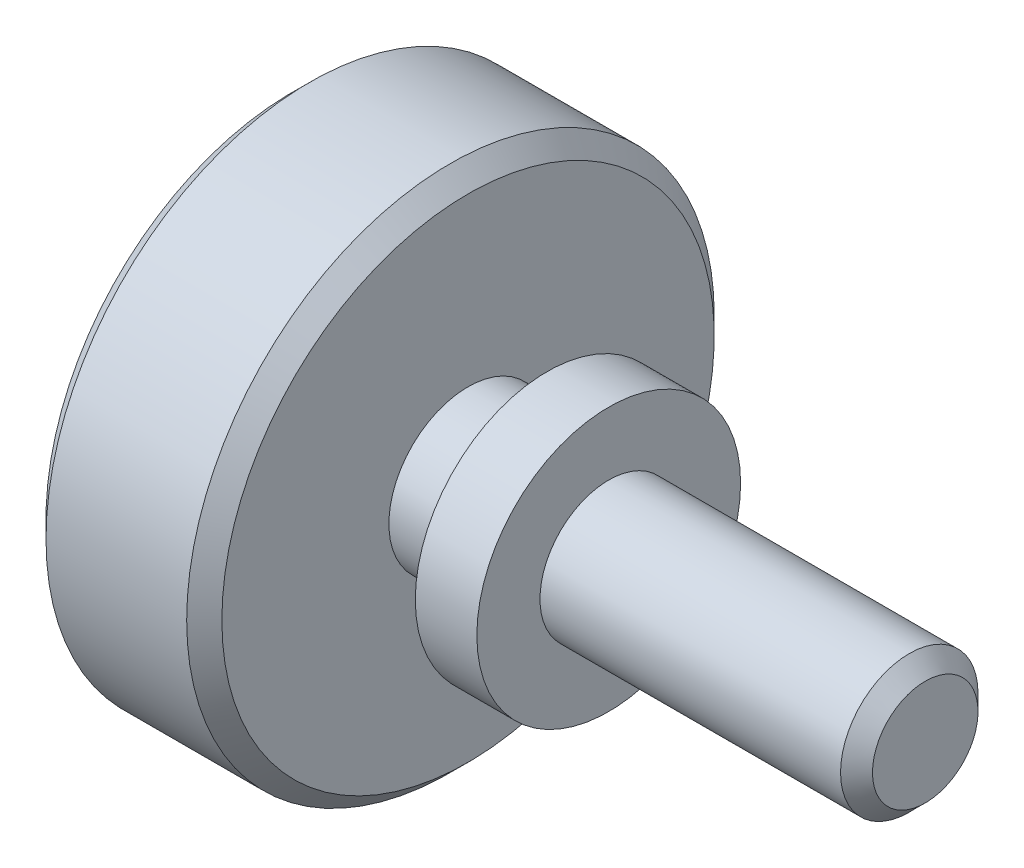
ISO-10303-21;
HEADER;
FILE_DESCRIPTION(('STEP AP214'),'2;1');
FILE_NAME('part.step','',(''),(''),'','','');
FILE_SCHEMA(('AUTOMOTIVE_DESIGN { 1 0 10303 214 1 1 1 1 }'));
ENDSEC;
DATA;
#1=APPLICATION_CONTEXT('core data for automotive mechanical design processes');
#2=APPLICATION_PROTOCOL_DEFINITION('international standard','automotive_design',2000,#1);
#3=PRODUCT_CONTEXT('',#1,'mechanical');
#4=PRODUCT('Part','Part','',(#3));
#5=PRODUCT_RELATED_PRODUCT_CATEGORY('part','',(#4));
#6=PRODUCT_DEFINITION_FORMATION('','',#4);
#7=PRODUCT_DEFINITION_CONTEXT('part definition',#1,'design');
#8=PRODUCT_DEFINITION('design','',#6,#7);
#9=PRODUCT_DEFINITION_SHAPE('','',#8);
#10=(LENGTH_UNIT() NAMED_UNIT(*) SI_UNIT(.MILLI.,.METRE.));
#11=(NAMED_UNIT(*) PLANE_ANGLE_UNIT() SI_UNIT($,.RADIAN.));
#12=(NAMED_UNIT(*) SI_UNIT($,.STERADIAN.) SOLID_ANGLE_UNIT());
#13=UNCERTAINTY_MEASURE_WITH_UNIT(LENGTH_MEASURE(1.E-05),#10,'distance_accuracy_value','');
#14=(GEOMETRIC_REPRESENTATION_CONTEXT(3) GLOBAL_UNCERTAINTY_ASSIGNED_CONTEXT((#13)) GLOBAL_UNIT_ASSIGNED_CONTEXT((#10,
#11,#12)) REPRESENTATION_CONTEXT('',''));
#15=CARTESIAN_POINT('',(0.,0.,0.));
#16=DIRECTION('',(0.,0.,1.));
#17=DIRECTION('',(1.,0.,0.));
#18=AXIS2_PLACEMENT_3D('',#15,#16,#17);
#19=CARTESIAN_POINT('',(18.,0.,0.));
#20=DIRECTION('',(1.,0.,0.));
#21=DIRECTION('',(0.,0.,-1.));
#22=AXIS2_PLACEMENT_3D('',#19,#20,#21);
#23=PLANE('',#22);
#24=CARTESIAN_POINT('',(17.9999999999723,0.,0.));
#25=DIRECTION('',(-1.,0.,0.));
#26=DIRECTION('',(0.,0.,1.));
#27=AXIS2_PLACEMENT_3D('',#24,#25,#26);
#28=CIRCLE('',#27,1.50000002980732);
#29=CARTESIAN_POINT('',(17.9999999999723,0.,1.50000002980732));
#30=VERTEX_POINT('',#29);
#31=EDGE_CURVE('E17',#30,#30,#28,.T.);
#32=ORIENTED_EDGE('',*,*,#31,.F.);
#33=EDGE_LOOP('',(#32));
#34=FACE_BOUND('',#33,.T.);
#35=ADVANCED_FACE('F14',(#34),#23,.T.);
#36=CARTESIAN_POINT('',(17.5460000297676,0.,0.));
#37=DIRECTION('',(-1.,0.,0.));
#38=DIRECTION('',(0.,0.,1.));
#39=AXIS2_PLACEMENT_3D('',#36,#37,#38);
#40=CONICAL_SURFACE('',#39,1.95399999995516,0.785398163334845);
#41=ORIENTED_EDGE('',*,*,#31,.T.);
#42=EDGE_LOOP('',(#41));
#43=FACE_BOUND('',#42,.T.);
#44=CARTESIAN_POINT('',(17.5460000298023,0.,0.));
#45=DIRECTION('',(1.,0.,0.));
#46=DIRECTION('',(0.,0.,-1.));
#47=AXIS2_PLACEMENT_3D('',#44,#45,#46);
#48=CIRCLE('',#47,1.954);
#49=CARTESIAN_POINT('',(17.5460000298023,0.,-1.954));
#50=VERTEX_POINT('',#49);
#51=EDGE_CURVE('E33',#50,#50,#48,.F.);
#52=ORIENTED_EDGE('',*,*,#51,.F.);
#53=EDGE_LOOP('',(#52));
#54=FACE_BOUND('',#53,.T.);
#55=ADVANCED_FACE('F63',(#43,#54),#40,.T.);
#56=CARTESIAN_POINT('',(9.,0.,0.));
#57=DIRECTION('',(1.,0.,0.));
#58=DIRECTION('',(0.,0.,-1.));
#59=AXIS2_PLACEMENT_3D('',#56,#57,#58);
#60=CYLINDRICAL_SURFACE('',#59,1.954);
#61=ORIENTED_EDGE('',*,*,#51,.T.);
#62=EDGE_LOOP('',(#61));
#63=FACE_BOUND('',#62,.T.);
#64=CARTESIAN_POINT('',(9.,0.,0.));
#65=DIRECTION('',(1.,0.,0.));
#66=DIRECTION('',(0.,0.,-1.));
#67=AXIS2_PLACEMENT_3D('',#64,#65,#66);
#68=CIRCLE('',#67,1.954);
#69=CARTESIAN_POINT('',(9.,0.,-1.954));
#70=VERTEX_POINT('',#69);
#71=EDGE_CURVE('E36',#70,#70,#68,.F.);
#72=ORIENTED_EDGE('',*,*,#71,.F.);
#73=EDGE_LOOP('',(#72));
#74=FACE_BOUND('',#73,.T.);
#75=ADVANCED_FACE('F61',(#63,#74),#60,.T.);
#76=CARTESIAN_POINT('',(9.,0.,0.));
#77=DIRECTION('',(1.,0.,0.));
#78=DIRECTION('',(0.,0.,-1.));
#79=AXIS2_PLACEMENT_3D('',#76,#77,#78);
#80=PLANE('',#79);
#81=ORIENTED_EDGE('',*,*,#71,.T.);
#82=EDGE_LOOP('',(#81));
#83=FACE_BOUND('',#82,.T.);
#84=CARTESIAN_POINT('',(9.,0.,0.));
#85=DIRECTION('',(1.,0.,0.));
#86=DIRECTION('',(0.,0.,-1.));
#87=AXIS2_PLACEMENT_3D('',#84,#85,#86);
#88=CIRCLE('',#87,3.75);
#89=CARTESIAN_POINT('',(9.,0.,-3.75));
#90=VERTEX_POINT('',#89);
#91=EDGE_CURVE('E53',#90,#90,#88,.F.);
#92=ORIENTED_EDGE('',*,*,#91,.F.);
#93=EDGE_LOOP('',(#92));
#94=FACE_BOUND('',#93,.T.);
#95=ADVANCED_FACE('F58',(#83,#94),#80,.T.);
#96=CARTESIAN_POINT('',(7.25,0.,0.));
#97=DIRECTION('',(1.,0.,0.));
#98=DIRECTION('',(0.,0.,-1.));
#99=AXIS2_PLACEMENT_3D('',#96,#97,#98);
#100=CYLINDRICAL_SURFACE('',#99,3.75);
#101=CARTESIAN_POINT('',(7.25,0.,0.));
#102=DIRECTION('',(1.,0.,0.));
#103=DIRECTION('',(0.,0.,-1.));
#104=AXIS2_PLACEMENT_3D('',#101,#102,#103);
#105=CIRCLE('',#104,3.75);
#106=CARTESIAN_POINT('',(7.25,0.,-3.75));
#107=VERTEX_POINT('',#106);
#108=EDGE_CURVE('E50',#107,#107,#105,.T.);
#109=ORIENTED_EDGE('',*,*,#108,.T.);
#110=EDGE_LOOP('',(#109));
#111=FACE_BOUND('',#110,.T.);
#112=ORIENTED_EDGE('',*,*,#91,.T.);
#113=EDGE_LOOP('',(#112));
#114=FACE_BOUND('',#113,.T.);
#115=ADVANCED_FACE('F71',(#111,#114),#100,.T.);
#116=CARTESIAN_POINT('',(7.25,0.,0.));
#117=DIRECTION('',(1.,0.,0.));
#118=DIRECTION('',(0.,0.,-1.));
#119=AXIS2_PLACEMENT_3D('',#116,#117,#118);
#120=PLANE('',#119);
#121=CARTESIAN_POINT('',(7.25,0.,0.));
#122=DIRECTION('',(1.,0.,0.));
#123=DIRECTION('',(0.,0.,-1.));
#124=AXIS2_PLACEMENT_3D('',#121,#122,#123);
#125=CIRCLE('',#124,2.25);
#126=CARTESIAN_POINT('',(7.25,0.,-2.25));
#127=VERTEX_POINT('',#126);
#128=EDGE_CURVE('E47',#127,#127,#125,.F.);
#129=ORIENTED_EDGE('',*,*,#128,.F.);
#130=EDGE_LOOP('',(#129));
#131=FACE_BOUND('',#130,.T.);
#132=ORIENTED_EDGE('',*,*,#108,.F.);
#133=EDGE_LOOP('',(#132));
#134=FACE_BOUND('',#133,.T.);
#135=ADVANCED_FACE('F100',(#131,#134),#120,.F.);
#136=CARTESIAN_POINT('',(5.,0.,0.));
#137=DIRECTION('',(1.,0.,0.));
#138=DIRECTION('',(0.,0.,-1.));
#139=AXIS2_PLACEMENT_3D('',#136,#137,#138);
#140=CYLINDRICAL_SURFACE('',#139,2.25);
#141=CARTESIAN_POINT('',(5.,0.,0.));
#142=DIRECTION('',(1.,0.,0.));
#143=DIRECTION('',(0.,0.,-1.));
#144=AXIS2_PLACEMENT_3D('',#141,#142,#143);
#145=CIRCLE('',#144,2.25);
#146=CARTESIAN_POINT('',(5.,0.,-2.25));
#147=VERTEX_POINT('',#146);
#148=EDGE_CURVE('E44',#147,#147,#145,.F.);
#149=ORIENTED_EDGE('',*,*,#148,.F.);
#150=EDGE_LOOP('',(#149));
#151=FACE_BOUND('',#150,.T.);
#152=ORIENTED_EDGE('',*,*,#128,.T.);
#153=EDGE_LOOP('',(#152));
#154=FACE_BOUND('',#153,.T.);
#155=ADVANCED_FACE('F96',(#151,#154),#140,.T.);
#156=CARTESIAN_POINT('',(0.,0.,0.));
#157=DIRECTION('',(1.,0.,0.));
#158=DIRECTION('',(0.,0.,-1.));
#159=AXIS2_PLACEMENT_3D('',#156,#157,#158);
#160=PLANE('',#159);
#161=CARTESIAN_POINT('',(0.,0.,0.));
#162=DIRECTION('',(1.,0.,0.));
#163=DIRECTION('',(0.,0.,-1.));
#164=AXIS2_PLACEMENT_3D('',#161,#162,#163);
#165=CIRCLE('',#164,7.);
#166=CARTESIAN_POINT('',(0.,0.,-7.));
#167=VERTEX_POINT('',#166);
#168=EDGE_CURVE('E41',#167,#167,#165,.T.);
#169=ORIENTED_EDGE('',*,*,#168,.F.);
#170=EDGE_LOOP('',(#169));
#171=FACE_BOUND('',#170,.T.);
#172=ADVANCED_FACE('F92',(#171),#160,.F.);
#173=CARTESIAN_POINT('',(5.,0.,0.));
#174=DIRECTION('',(1.,0.,0.));
#175=DIRECTION('',(0.,0.,-1.));
#176=AXIS2_PLACEMENT_3D('',#173,#174,#175);
#177=PLANE('',#176);
#178=ORIENTED_EDGE('',*,*,#148,.T.);
#179=EDGE_LOOP('',(#178));
#180=FACE_BOUND('',#179,.T.);
#181=CARTESIAN_POINT('',(5.,0.,0.));
#182=DIRECTION('',(-1.,0.,0.));
#183=DIRECTION('',(0.,0.,1.));
#184=AXIS2_PLACEMENT_3D('',#181,#182,#183);
#185=CIRCLE('',#184,7.);
#186=CARTESIAN_POINT('',(5.,0.,7.));
#187=VERTEX_POINT('',#186);
#188=EDGE_CURVE('E26',#187,#187,#185,.T.);
#189=ORIENTED_EDGE('',*,*,#188,.F.);
#190=EDGE_LOOP('',(#189));
#191=FACE_BOUND('',#190,.T.);
#192=ADVANCED_FACE('F88',(#180,#191),#177,.T.);
#193=CARTESIAN_POINT('',(0.5,0.,0.));
#194=DIRECTION('',(1.,0.,0.));
#195=DIRECTION('',(0.,0.,-1.));
#196=AXIS2_PLACEMENT_3D('',#193,#194,#195);
#197=CONICAL_SURFACE('',#196,7.5,0.785398163397449);
#198=CARTESIAN_POINT('',(0.5,0.,0.));
#199=DIRECTION('',(1.,0.,0.));
#200=DIRECTION('',(0.,0.,-1.));
#201=AXIS2_PLACEMENT_3D('',#198,#199,#200);
#202=CIRCLE('',#201,7.5);
#203=CARTESIAN_POINT('',(0.5,0.,-7.5));
#204=VERTEX_POINT('',#203);
#205=EDGE_CURVE('E21',#204,#204,#202,.T.);
#206=ORIENTED_EDGE('',*,*,#205,.F.);
#207=EDGE_LOOP('',(#206));
#208=FACE_BOUND('',#207,.T.);
#209=ORIENTED_EDGE('',*,*,#168,.T.);
#210=EDGE_LOOP('',(#209));
#211=FACE_BOUND('',#210,.T.);
#212=ADVANCED_FACE('F81',(#208,#211),#197,.T.);
#213=CARTESIAN_POINT('',(4.5,0.,0.));
#214=DIRECTION('',(-1.,0.,0.));
#215=DIRECTION('',(0.,0.,1.));
#216=AXIS2_PLACEMENT_3D('',#213,#214,#215);
#217=CONICAL_SURFACE('',#216,7.5,0.785398163397449);
#218=ORIENTED_EDGE('',*,*,#188,.T.);
#219=EDGE_LOOP('',(#218));
#220=FACE_BOUND('',#219,.T.);
#221=CARTESIAN_POINT('',(4.5,0.,0.));
#222=DIRECTION('',(1.,0.,0.));
#223=DIRECTION('',(0.,0.,-1.));
#224=AXIS2_PLACEMENT_3D('',#221,#222,#223);
#225=CIRCLE('',#224,7.5);
#226=CARTESIAN_POINT('',(4.5,0.,-7.5));
#227=VERTEX_POINT('',#226);
#228=EDGE_CURVE('E10',#227,#227,#225,.F.);
#229=ORIENTED_EDGE('',*,*,#228,.F.);
#230=EDGE_LOOP('',(#229));
#231=FACE_BOUND('',#230,.T.);
#232=ADVANCED_FACE('F76',(#220,#231),#217,.T.);
#233=CARTESIAN_POINT('',(0.,0.,0.));
#234=DIRECTION('',(1.,0.,0.));
#235=DIRECTION('',(0.,0.,-1.));
#236=AXIS2_PLACEMENT_3D('',#233,#234,#235);
#237=CYLINDRICAL_SURFACE('',#236,7.5);
#238=ORIENTED_EDGE('',*,*,#228,.T.);
#239=EDGE_LOOP('',(#238));
#240=FACE_BOUND('',#239,.T.);
#241=ORIENTED_EDGE('',*,*,#205,.T.);
#242=EDGE_LOOP('',(#241));
#243=FACE_BOUND('',#242,.T.);
#244=ADVANCED_FACE('F74',(#240,#243),#237,.T.);
#245=CLOSED_SHELL('',(#35,#55,#75,#95,#115,#135,#155,#172,#192,#212,#232,#244));
#246=MANIFOLD_SOLID_BREP('B1',#245);
#247=ADVANCED_BREP_SHAPE_REPRESENTATION('',(#18,#246),#14);
#248=SHAPE_DEFINITION_REPRESENTATION(#9,#247);
ENDSEC;
END-ISO-10303-21;
